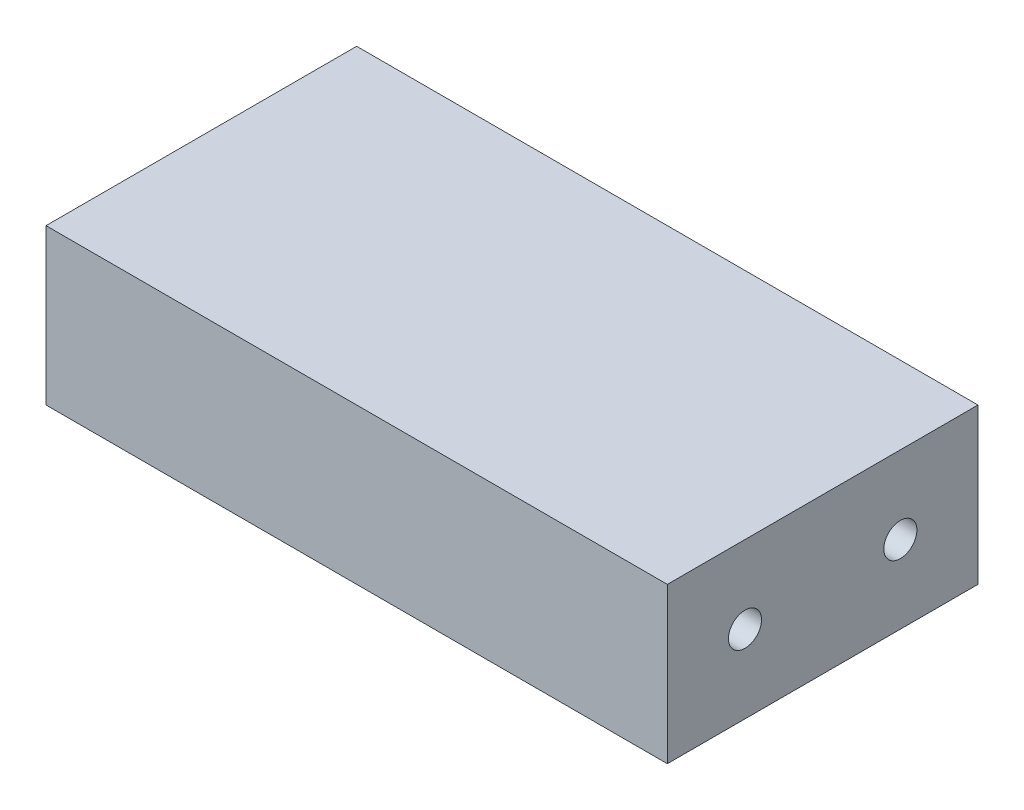
ISO-10303-21;
HEADER;
FILE_DESCRIPTION(('STEP AP214'),'2;1');
FILE_NAME('part.step','',(''),(''),'','','');
FILE_SCHEMA(('AUTOMOTIVE_DESIGN { 1 0 10303 214 1 1 1 1 }'));
ENDSEC;
DATA;
#1=APPLICATION_CONTEXT('core data for automotive mechanical design processes');
#2=APPLICATION_PROTOCOL_DEFINITION('international standard','automotive_design',2000,#1);
#3=PRODUCT_CONTEXT('',#1,'mechanical');
#4=PRODUCT('Part','Part','',(#3));
#5=PRODUCT_RELATED_PRODUCT_CATEGORY('part','',(#4));
#6=PRODUCT_DEFINITION_FORMATION('','',#4);
#7=PRODUCT_DEFINITION_CONTEXT('part definition',#1,'design');
#8=PRODUCT_DEFINITION('design','',#6,#7);
#9=PRODUCT_DEFINITION_SHAPE('','',#8);
#10=(LENGTH_UNIT() NAMED_UNIT(*) SI_UNIT(.MILLI.,.METRE.));
#11=(NAMED_UNIT(*) PLANE_ANGLE_UNIT() SI_UNIT($,.RADIAN.));
#12=(NAMED_UNIT(*) SI_UNIT($,.STERADIAN.) SOLID_ANGLE_UNIT());
#13=UNCERTAINTY_MEASURE_WITH_UNIT(LENGTH_MEASURE(1.E-05),#10,'distance_accuracy_value','');
#14=(GEOMETRIC_REPRESENTATION_CONTEXT(3) GLOBAL_UNCERTAINTY_ASSIGNED_CONTEXT((#13)) GLOBAL_UNIT_ASSIGNED_CONTEXT((#10,
#11,#12)) REPRESENTATION_CONTEXT('',''));
#15=CARTESIAN_POINT('',(0.,0.,0.));
#16=DIRECTION('',(0.,0.,1.));
#17=DIRECTION('',(1.,0.,0.));
#18=AXIS2_PLACEMENT_3D('',#15,#16,#17);
#19=CARTESIAN_POINT('',(24.8,12.7,-19.0666666666667));
#20=DIRECTION('',(0.,0.,1.));
#21=DIRECTION('',(1.,0.,0.));
#22=AXIS2_PLACEMENT_3D('',#19,#20,#21);
#23=PLANE('',#22);
#24=DIRECTION('',(-1.,0.,0.));
#25=VECTOR('',#24,1.);
#26=CARTESIAN_POINT('',(24.8,0.,-19.0666666666667));
#27=LINE('',#26,#25);
#28=CARTESIAN_POINT('',(24.8,0.,-19.0666666666667));
#29=VERTEX_POINT('',#28);
#30=CARTESIAN_POINT('',(-26.,0.,-19.0666666666667));
#31=VERTEX_POINT('',#30);
#32=EDGE_CURVE('E126',#29,#31,#27,.T.);
#33=ORIENTED_EDGE('',*,*,#32,.T.);
#34=DIRECTION('',(0.,-1.,0.));
#35=VECTOR('',#34,1.);
#36=CARTESIAN_POINT('',(-26.,12.7,-19.0666666666667));
#37=LINE('',#36,#35);
#38=CARTESIAN_POINT('',(-26.,12.7,-19.0666666666667));
#39=VERTEX_POINT('',#38);
#40=EDGE_CURVE('E11',#39,#31,#37,.T.);
#41=ORIENTED_EDGE('',*,*,#40,.F.);
#42=DIRECTION('',(-1.,0.,0.));
#43=VECTOR('',#42,1.);
#44=CARTESIAN_POINT('',(24.8,12.7,-19.0666666666667));
#45=LINE('',#44,#43);
#46=CARTESIAN_POINT('',(24.8,12.7,-19.0666666666667));
#47=VERTEX_POINT('',#46);
#48=EDGE_CURVE('E127',#47,#39,#45,.T.);
#49=ORIENTED_EDGE('',*,*,#48,.F.);
#50=DIRECTION('',(0.,-1.,0.));
#51=VECTOR('',#50,1.);
#52=CARTESIAN_POINT('',(24.8,12.7,-19.0666666666667));
#53=LINE('',#52,#51);
#54=EDGE_CURVE('E133',#47,#29,#53,.T.);
#55=ORIENTED_EDGE('',*,*,#54,.T.);
#56=EDGE_LOOP('',(#33,#41,#49,#55));
#57=FACE_BOUND('',#56,.T.);
#58=ADVANCED_FACE('F33',(#57),#23,.F.);
#59=CARTESIAN_POINT('',(-26.,12.7,-19.0666666666667));
#60=DIRECTION('',(1.,0.,0.));
#61=DIRECTION('',(0.,0.,-1.));
#62=AXIS2_PLACEMENT_3D('',#59,#60,#61);
#63=PLANE('',#62);
#64=CARTESIAN_POINT('',(-26.,6.35,-0.0166666666666491));
#65=DIRECTION('',(-1.,0.,0.));
#66=DIRECTION('',(0.,0.,1.));
#67=AXIS2_PLACEMENT_3D('',#64,#65,#66);
#68=CIRCLE('',#67,1.35254999999999);
#69=CARTESIAN_POINT('',(-26.,6.35,1.33588333333334));
#70=VERTEX_POINT('',#69);
#71=EDGE_CURVE('E104',#70,#70,#68,.T.);
#72=ORIENTED_EDGE('',*,*,#71,.F.);
#73=EDGE_LOOP('',(#72));
#74=FACE_BOUND('',#73,.T.);
#75=CARTESIAN_POINT('',(-26.,6.35,-12.7166666666667));
#76=DIRECTION('',(-1.,0.,0.));
#77=DIRECTION('',(0.,0.,1.));
#78=AXIS2_PLACEMENT_3D('',#75,#76,#77);
#79=CIRCLE('',#78,1.35254999999999);
#80=CARTESIAN_POINT('',(-26.,6.35,-11.3641166666667));
#81=VERTEX_POINT('',#80);
#82=EDGE_CURVE('E103',#81,#81,#79,.T.);
#83=ORIENTED_EDGE('',*,*,#82,.F.);
#84=EDGE_LOOP('',(#83));
#85=FACE_BOUND('',#84,.T.);
#86=DIRECTION('',(0.,0.,1.));
#87=VECTOR('',#86,1.);
#88=CARTESIAN_POINT('',(-26.,0.,-19.0666666666667));
#89=LINE('',#88,#87);
#90=CARTESIAN_POINT('',(-26.,0.,6.33333333333334));
#91=VERTEX_POINT('',#90);
#92=EDGE_CURVE('E136',#31,#91,#89,.T.);
#93=ORIENTED_EDGE('',*,*,#92,.T.);
#94=DIRECTION('',(0.,-1.,0.));
#95=VECTOR('',#94,1.);
#96=CARTESIAN_POINT('',(-26.,12.7,6.33333333333334));
#97=LINE('',#96,#95);
#98=CARTESIAN_POINT('',(-26.,12.7,6.33333333333334));
#99=VERTEX_POINT('',#98);
#100=EDGE_CURVE('E41',#99,#91,#97,.T.);
#101=ORIENTED_EDGE('',*,*,#100,.F.);
#102=DIRECTION('',(0.,0.,1.));
#103=VECTOR('',#102,1.);
#104=CARTESIAN_POINT('',(-26.,12.7,-19.0666666666667));
#105=LINE('',#104,#103);
#106=EDGE_CURVE('E80',#39,#99,#105,.T.);
#107=ORIENTED_EDGE('',*,*,#106,.F.);
#108=ORIENTED_EDGE('',*,*,#40,.T.);
#109=EDGE_LOOP('',(#93,#101,#107,#108));
#110=FACE_BOUND('',#109,.T.);
#111=ADVANCED_FACE('F160',(#74,#85,#110),#63,.F.);
#112=CARTESIAN_POINT('',(-26.,12.7,6.33333333333334));
#113=DIRECTION('',(0.,0.,-1.));
#114=DIRECTION('',(-1.,0.,0.));
#115=AXIS2_PLACEMENT_3D('',#112,#113,#114);
#116=PLANE('',#115);
#117=DIRECTION('',(1.,0.,0.));
#118=VECTOR('',#117,1.);
#119=CARTESIAN_POINT('',(-26.,0.,6.33333333333334));
#120=LINE('',#119,#118);
#121=CARTESIAN_POINT('',(24.8,0.,6.33333333333334));
#122=VERTEX_POINT('',#121);
#123=EDGE_CURVE('E67',#91,#122,#120,.T.);
#124=ORIENTED_EDGE('',*,*,#123,.T.);
#125=DIRECTION('',(0.,-1.,0.));
#126=VECTOR('',#125,1.);
#127=CARTESIAN_POINT('',(24.8,12.7,6.33333333333334));
#128=LINE('',#127,#126);
#129=CARTESIAN_POINT('',(24.8,12.7,6.33333333333334));
#130=VERTEX_POINT('',#129);
#131=EDGE_CURVE('E141',#130,#122,#128,.T.);
#132=ORIENTED_EDGE('',*,*,#131,.F.);
#133=DIRECTION('',(1.,0.,0.));
#134=VECTOR('',#133,1.);
#135=CARTESIAN_POINT('',(-26.,12.7,6.33333333333334));
#136=LINE('',#135,#134);
#137=EDGE_CURVE('E130',#99,#130,#136,.T.);
#138=ORIENTED_EDGE('',*,*,#137,.F.);
#139=ORIENTED_EDGE('',*,*,#100,.T.);
#140=EDGE_LOOP('',(#124,#132,#138,#139));
#141=FACE_BOUND('',#140,.T.);
#142=ADVANCED_FACE('F143',(#141),#116,.F.);
#143=CARTESIAN_POINT('',(24.8,12.7,6.33333333333334));
#144=DIRECTION('',(-1.,0.,0.));
#145=DIRECTION('',(0.,0.,1.));
#146=AXIS2_PLACEMENT_3D('',#143,#144,#145);
#147=PLANE('',#146);
#148=CARTESIAN_POINT('',(24.8,6.35,-0.0166666666666561));
#149=DIRECTION('',(1.,0.,0.));
#150=DIRECTION('',(0.,0.,-1.));
#151=AXIS2_PLACEMENT_3D('',#148,#149,#150);
#152=CIRCLE('',#151,1.35254999999999);
#153=CARTESIAN_POINT('',(24.8,6.35,-1.36921666666664));
#154=VERTEX_POINT('',#153);
#155=EDGE_CURVE('E114',#154,#154,#152,.T.);
#156=ORIENTED_EDGE('',*,*,#155,.F.);
#157=EDGE_LOOP('',(#156));
#158=FACE_BOUND('',#157,.T.);
#159=CARTESIAN_POINT('',(24.8,6.35,-12.7166666666667));
#160=DIRECTION('',(1.,0.,0.));
#161=DIRECTION('',(0.,0.,-1.));
#162=AXIS2_PLACEMENT_3D('',#159,#160,#161);
#163=CIRCLE('',#162,1.35254999999999);
#164=CARTESIAN_POINT('',(24.8,6.35,-14.0692166666666));
#165=VERTEX_POINT('',#164);
#166=EDGE_CURVE('E120',#165,#165,#163,.T.);
#167=ORIENTED_EDGE('',*,*,#166,.F.);
#168=EDGE_LOOP('',(#167));
#169=FACE_BOUND('',#168,.T.);
#170=DIRECTION('',(0.,0.,-1.));
#171=VECTOR('',#170,1.);
#172=CARTESIAN_POINT('',(24.8,0.,6.33333333333334));
#173=LINE('',#172,#171);
#174=EDGE_CURVE('E73',#122,#29,#173,.T.);
#175=ORIENTED_EDGE('',*,*,#174,.T.);
#176=ORIENTED_EDGE('',*,*,#54,.F.);
#177=DIRECTION('',(0.,0.,-1.));
#178=VECTOR('',#177,1.);
#179=CARTESIAN_POINT('',(24.8,12.7,6.33333333333334));
#180=LINE('',#179,#178);
#181=EDGE_CURVE('E49',#130,#47,#180,.T.);
#182=ORIENTED_EDGE('',*,*,#181,.F.);
#183=ORIENTED_EDGE('',*,*,#131,.T.);
#184=EDGE_LOOP('',(#175,#176,#182,#183));
#185=FACE_BOUND('',#184,.T.);
#186=ADVANCED_FACE('F150',(#158,#169,#185),#147,.F.);
#187=CARTESIAN_POINT('',(0.,12.7,0.));
#188=DIRECTION('',(0.,1.,0.));
#189=DIRECTION('',(0.,0.,1.));
#190=AXIS2_PLACEMENT_3D('',#187,#188,#189);
#191=PLANE('',#190);
#192=ORIENTED_EDGE('',*,*,#48,.T.);
#193=ORIENTED_EDGE('',*,*,#106,.T.);
#194=ORIENTED_EDGE('',*,*,#137,.T.);
#195=ORIENTED_EDGE('',*,*,#181,.T.);
#196=EDGE_LOOP('',(#192,#193,#194,#195));
#197=FACE_BOUND('',#196,.T.);
#198=ADVANCED_FACE('F152',(#197),#191,.T.);
#199=CARTESIAN_POINT('',(0.,0.,0.));
#200=DIRECTION('',(0.,1.,0.));
#201=DIRECTION('',(0.,0.,1.));
#202=AXIS2_PLACEMENT_3D('',#199,#200,#201);
#203=PLANE('',#202);
#204=ORIENTED_EDGE('',*,*,#32,.F.);
#205=ORIENTED_EDGE('',*,*,#174,.F.);
#206=ORIENTED_EDGE('',*,*,#123,.F.);
#207=ORIENTED_EDGE('',*,*,#92,.F.);
#208=EDGE_LOOP('',(#204,#205,#206,#207));
#209=FACE_BOUND('',#208,.T.);
#210=ADVANCED_FACE('F146',(#209),#203,.F.);
#211=CARTESIAN_POINT('',(12.1,6.35,-12.7166666666667));
#212=DIRECTION('',(1.,0.,0.));
#213=DIRECTION('',(0.,0.,-1.));
#214=AXIS2_PLACEMENT_3D('',#211,#212,#213);
#215=CONICAL_SURFACE('',#214,1.35255,1.02974425867665);
#216=CARTESIAN_POINT('',(11.2873059697343,6.35,-12.7166666666667));
#217=VERTEX_POINT('',#216);
#218=VERTEX_LOOP('',#217);
#219=FACE_BOUND('',#218,.T.);
#220=CARTESIAN_POINT('',(12.1,6.35,-12.7166666666667));
#221=DIRECTION('',(1.,0.,0.));
#222=DIRECTION('',(0.,0.,-1.));
#223=AXIS2_PLACEMENT_3D('',#220,#221,#222);
#224=CIRCLE('',#223,1.35255);
#225=CARTESIAN_POINT('',(12.1,6.35,-14.0692166666667));
#226=VERTEX_POINT('',#225);
#227=EDGE_CURVE('E123',#226,#226,#224,.T.);
#228=ORIENTED_EDGE('',*,*,#227,.T.);
#229=EDGE_LOOP('',(#228));
#230=FACE_BOUND('',#229,.T.);
#231=ADVANCED_FACE('F199',(#219,#230),#215,.F.);
#232=CARTESIAN_POINT('',(24.8,6.35,-12.7166666666667));
#233=DIRECTION('',(1.,0.,0.));
#234=DIRECTION('',(0.,0.,-1.));
#235=AXIS2_PLACEMENT_3D('',#232,#233,#234);
#236=CYLINDRICAL_SURFACE('',#235,1.35254999999999);
#237=ORIENTED_EDGE('',*,*,#227,.F.);
#238=EDGE_LOOP('',(#237));
#239=FACE_BOUND('',#238,.T.);
#240=ORIENTED_EDGE('',*,*,#166,.T.);
#241=EDGE_LOOP('',(#240));
#242=FACE_BOUND('',#241,.T.);
#243=ADVANCED_FACE('F195',(#239,#242),#236,.F.);
#244=CARTESIAN_POINT('',(12.1,6.35,-0.0166666666666543));
#245=DIRECTION('',(1.,0.,0.));
#246=DIRECTION('',(0.,0.,-1.));
#247=AXIS2_PLACEMENT_3D('',#244,#245,#246);
#248=CONICAL_SURFACE('',#247,1.35255,1.02974425867665);
#249=CARTESIAN_POINT('',(11.2873059697343,6.35,-0.0166666666666542));
#250=VERTEX_POINT('',#249);
#251=VERTEX_LOOP('',#250);
#252=FACE_BOUND('',#251,.T.);
#253=CARTESIAN_POINT('',(12.1,6.35,-0.0166666666666543));
#254=DIRECTION('',(1.,0.,0.));
#255=DIRECTION('',(0.,0.,-1.));
#256=AXIS2_PLACEMENT_3D('',#253,#254,#255);
#257=CIRCLE('',#256,1.35255);
#258=CARTESIAN_POINT('',(12.1,6.35,-1.36921666666665));
#259=VERTEX_POINT('',#258);
#260=EDGE_CURVE('E117',#259,#259,#257,.T.);
#261=ORIENTED_EDGE('',*,*,#260,.T.);
#262=EDGE_LOOP('',(#261));
#263=FACE_BOUND('',#262,.T.);
#264=ADVANCED_FACE('F191',(#252,#263),#248,.F.);
#265=CARTESIAN_POINT('',(24.8,6.35,-0.0166666666666561));
#266=DIRECTION('',(1.,0.,0.));
#267=DIRECTION('',(0.,0.,-1.));
#268=AXIS2_PLACEMENT_3D('',#265,#266,#267);
#269=CYLINDRICAL_SURFACE('',#268,1.35254999999999);
#270=ORIENTED_EDGE('',*,*,#260,.F.);
#271=EDGE_LOOP('',(#270));
#272=FACE_BOUND('',#271,.T.);
#273=ORIENTED_EDGE('',*,*,#155,.T.);
#274=EDGE_LOOP('',(#273));
#275=FACE_BOUND('',#274,.T.);
#276=ADVANCED_FACE('F183',(#272,#275),#269,.F.);
#277=CARTESIAN_POINT('',(-13.3,6.35,-12.7166666666667));
#278=DIRECTION('',(-1.,0.,0.));
#279=DIRECTION('',(0.,0.,1.));
#280=AXIS2_PLACEMENT_3D('',#277,#278,#279);
#281=CONICAL_SURFACE('',#280,1.35255,1.02974425867665);
#282=CARTESIAN_POINT('',(-12.4873059697343,6.35,-12.7166666666667));
#283=VERTEX_POINT('',#282);
#284=VERTEX_LOOP('',#283);
#285=FACE_BOUND('',#284,.T.);
#286=CARTESIAN_POINT('',(-13.3,6.35,-12.7166666666667));
#287=DIRECTION('',(-1.,0.,0.));
#288=DIRECTION('',(0.,0.,1.));
#289=AXIS2_PLACEMENT_3D('',#286,#287,#288);
#290=CIRCLE('',#289,1.35255);
#291=CARTESIAN_POINT('',(-13.3,6.35,-11.3641166666667));
#292=VERTEX_POINT('',#291);
#293=EDGE_CURVE('E107',#292,#292,#290,.T.);
#294=ORIENTED_EDGE('',*,*,#293,.T.);
#295=EDGE_LOOP('',(#294));
#296=FACE_BOUND('',#295,.T.);
#297=ADVANCED_FACE('F177',(#285,#296),#281,.F.);
#298=CARTESIAN_POINT('',(-26.,6.35,-12.7166666666667));
#299=DIRECTION('',(-1.,0.,0.));
#300=DIRECTION('',(0.,0.,1.));
#301=AXIS2_PLACEMENT_3D('',#298,#299,#300);
#302=CYLINDRICAL_SURFACE('',#301,1.35254999999999);
#303=ORIENTED_EDGE('',*,*,#293,.F.);
#304=EDGE_LOOP('',(#303));
#305=FACE_BOUND('',#304,.T.);
#306=ORIENTED_EDGE('',*,*,#82,.T.);
#307=EDGE_LOOP('',(#306));
#308=FACE_BOUND('',#307,.T.);
#309=ADVANCED_FACE('F97',(#305,#308),#302,.F.);
#310=CARTESIAN_POINT('',(-13.3,6.35,-0.0166666666666509));
#311=DIRECTION('',(-1.,0.,0.));
#312=DIRECTION('',(0.,0.,1.));
#313=AXIS2_PLACEMENT_3D('',#310,#311,#312);
#314=CONICAL_SURFACE('',#313,1.35255,1.02974425867665);
#315=CARTESIAN_POINT('',(-12.4873059697343,6.35,-0.016666666666651));
#316=VERTEX_POINT('',#315);
#317=VERTEX_LOOP('',#316);
#318=FACE_BOUND('',#317,.T.);
#319=CARTESIAN_POINT('',(-13.3,6.35,-0.0166666666666509));
#320=DIRECTION('',(-1.,0.,0.));
#321=DIRECTION('',(0.,0.,1.));
#322=AXIS2_PLACEMENT_3D('',#319,#320,#321);
#323=CIRCLE('',#322,1.35255);
#324=CARTESIAN_POINT('',(-13.3,6.35,1.33588333333335));
#325=VERTEX_POINT('',#324);
#326=EDGE_CURVE('E101',#325,#325,#323,.T.);
#327=ORIENTED_EDGE('',*,*,#326,.T.);
#328=EDGE_LOOP('',(#327));
#329=FACE_BOUND('',#328,.T.);
#330=ADVANCED_FACE('F93',(#318,#329),#314,.F.);
#331=CARTESIAN_POINT('',(-26.,6.35,-0.0166666666666491));
#332=DIRECTION('',(-1.,0.,0.));
#333=DIRECTION('',(0.,0.,1.));
#334=AXIS2_PLACEMENT_3D('',#331,#332,#333);
#335=CYLINDRICAL_SURFACE('',#334,1.35254999999999);
#336=ORIENTED_EDGE('',*,*,#326,.F.);
#337=EDGE_LOOP('',(#336));
#338=FACE_BOUND('',#337,.T.);
#339=ORIENTED_EDGE('',*,*,#71,.T.);
#340=EDGE_LOOP('',(#339));
#341=FACE_BOUND('',#340,.T.);
#342=ADVANCED_FACE('F96',(#338,#341),#335,.F.);
#343=CLOSED_SHELL('',(#58,#111,#142,#186,#198,#210,#231,#243,#264,#276,#297,#309,#330,#342));
#344=MANIFOLD_SOLID_BREP('B2',#343);
#345=ADVANCED_BREP_SHAPE_REPRESENTATION('',(#18,#344),#14);
#346=SHAPE_DEFINITION_REPRESENTATION(#9,#345);
ENDSEC;
END-ISO-10303-21;
